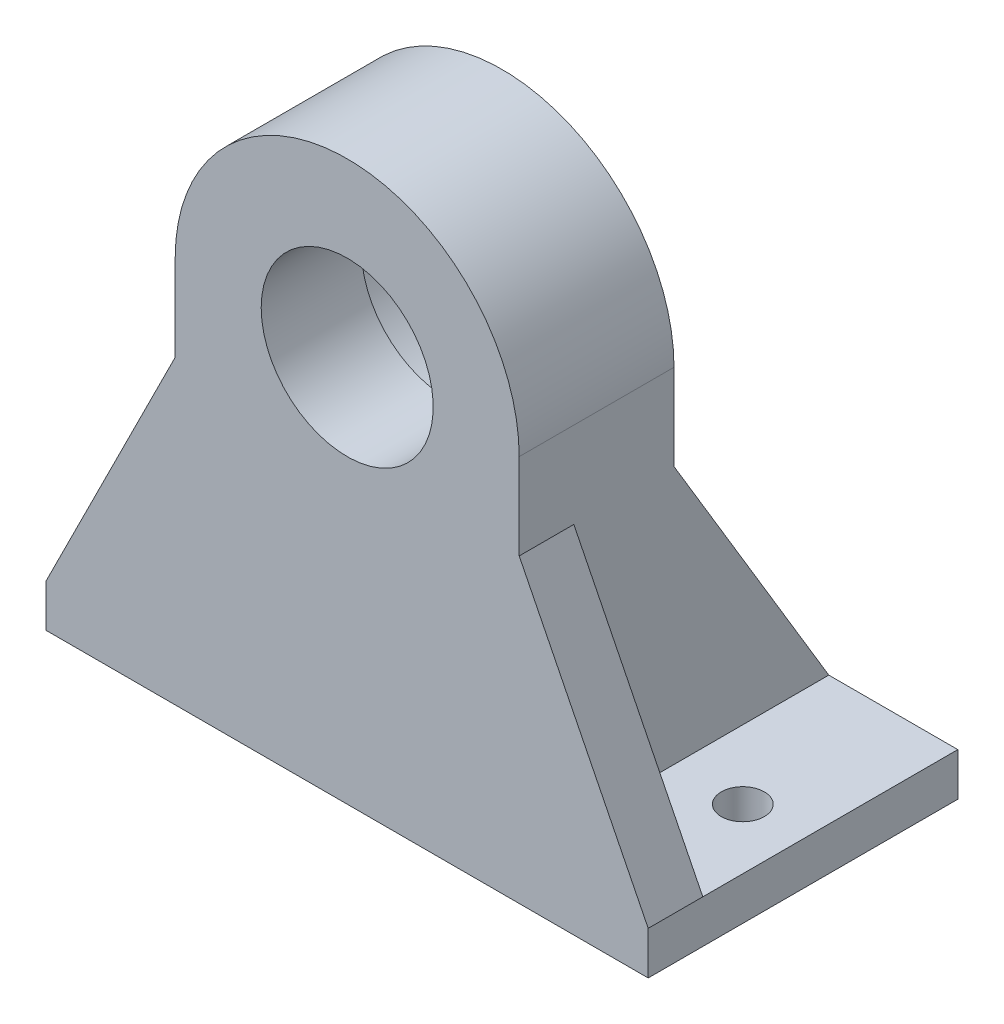
ISO-10303-21;
HEADER;
FILE_DESCRIPTION(('STEP AP214'),'2;1');
FILE_NAME('part.step','',(''),(''),'','','');
FILE_SCHEMA(('AUTOMOTIVE_DESIGN { 1 0 10303 214 1 1 1 1 }'));
ENDSEC;
DATA;
#1=APPLICATION_CONTEXT('core data for automotive mechanical design processes');
#2=APPLICATION_PROTOCOL_DEFINITION('international standard','automotive_design',2000,#1);
#3=PRODUCT_CONTEXT('',#1,'mechanical');
#4=PRODUCT('Part','Part','',(#3));
#5=PRODUCT_RELATED_PRODUCT_CATEGORY('part','',(#4));
#6=PRODUCT_DEFINITION_FORMATION('','',#4);
#7=PRODUCT_DEFINITION_CONTEXT('part definition',#1,'design');
#8=PRODUCT_DEFINITION('design','',#6,#7);
#9=PRODUCT_DEFINITION_SHAPE('','',#8);
#10=(LENGTH_UNIT() NAMED_UNIT(*) SI_UNIT(.MILLI.,.METRE.));
#11=(NAMED_UNIT(*) PLANE_ANGLE_UNIT() SI_UNIT($,.RADIAN.));
#12=(NAMED_UNIT(*) SI_UNIT($,.STERADIAN.) SOLID_ANGLE_UNIT());
#13=UNCERTAINTY_MEASURE_WITH_UNIT(LENGTH_MEASURE(1.E-05),#10,'distance_accuracy_value','');
#14=(GEOMETRIC_REPRESENTATION_CONTEXT(3) GLOBAL_UNCERTAINTY_ASSIGNED_CONTEXT((#13)) GLOBAL_UNIT_ASSIGNED_CONTEXT((#10,
#11,#12)) REPRESENTATION_CONTEXT('',''));
#15=CARTESIAN_POINT('',(0.,0.,0.));
#16=DIRECTION('',(0.,0.,1.));
#17=DIRECTION('',(1.,0.,0.));
#18=AXIS2_PLACEMENT_3D('',#15,#16,#17);
#19=CARTESIAN_POINT('',(0.,0.,0.));
#20=DIRECTION('',(0.,0.,1.));
#21=DIRECTION('',(1.,0.,0.));
#22=AXIS2_PLACEMENT_3D('',#19,#20,#21);
#23=PLANE('',#22);
#24=CARTESIAN_POINT('',(0.,0.,0.));
#25=DIRECTION('',(0.,0.,1.));
#26=DIRECTION('',(1.,0.,0.));
#27=AXIS2_PLACEMENT_3D('',#24,#25,#26);
#28=CIRCLE('',#27,14.7875);
#29=CARTESIAN_POINT('',(14.7875,0.,0.));
#30=VERTEX_POINT('',#29);
#31=EDGE_CURVE('E11',#30,#30,#28,.T.);
#32=ORIENTED_EDGE('',*,*,#31,.T.);
#33=EDGE_LOOP('',(#32));
#34=FACE_BOUND('',#33,.T.);
#35=DIRECTION('',(-1.,0.,0.));
#36=VECTOR('',#35,1.);
#37=CARTESIAN_POINT('',(-13.65,-10.,0.));
#38=LINE('',#37,#36);
#39=CARTESIAN_POINT('',(-13.65,-10.,0.));
#40=VERTEX_POINT('',#39);
#41=CARTESIAN_POINT('',(-20.,-10.,0.));
#42=VERTEX_POINT('',#41);
#43=EDGE_CURVE('E205',#40,#42,#38,.T.);
#44=ORIENTED_EDGE('',*,*,#43,.T.);
#45=DIRECTION('',(0.,-1.,0.));
#46=VECTOR('',#45,1.);
#47=CARTESIAN_POINT('',(-20.,0.,0.));
#48=LINE('',#47,#46);
#49=CARTESIAN_POINT('',(-20.,0.,0.));
#50=VERTEX_POINT('',#49);
#51=EDGE_CURVE('E292',#50,#42,#48,.T.);
#52=ORIENTED_EDGE('',*,*,#51,.F.);
#53=CARTESIAN_POINT('',(0.,0.,0.));
#54=DIRECTION('',(0.,0.,1.));
#55=DIRECTION('',(1.,0.,0.));
#56=AXIS2_PLACEMENT_3D('',#53,#54,#55);
#57=CIRCLE('',#56,20.);
#58=CARTESIAN_POINT('',(20.,0.,0.));
#59=VERTEX_POINT('',#58);
#60=EDGE_CURVE('E280',#59,#50,#57,.T.);
#61=ORIENTED_EDGE('',*,*,#60,.F.);
#62=DIRECTION('',(0.,1.,0.));
#63=VECTOR('',#62,1.);
#64=CARTESIAN_POINT('',(20.,-40.,0.));
#65=LINE('',#64,#63);
#66=CARTESIAN_POINT('',(20.,-10.,0.));
#67=VERTEX_POINT('',#66);
#68=EDGE_CURVE('E285',#67,#59,#65,.T.);
#69=ORIENTED_EDGE('',*,*,#68,.F.);
#70=DIRECTION('',(1.,0.,0.));
#71=VECTOR('',#70,1.);
#72=CARTESIAN_POINT('',(13.65,-10.,0.));
#73=LINE('',#72,#71);
#74=CARTESIAN_POINT('',(13.65,-10.,0.));
#75=VERTEX_POINT('',#74);
#76=EDGE_CURVE('E224',#75,#67,#73,.T.);
#77=ORIENTED_EDGE('',*,*,#76,.F.);
#78=DIRECTION('',(0.,-1.,0.));
#79=VECTOR('',#78,1.);
#80=CARTESIAN_POINT('',(13.65,-10.,0.));
#81=LINE('',#80,#79);
#82=CARTESIAN_POINT('',(13.65,-40.,0.));
#83=VERTEX_POINT('',#82);
#84=EDGE_CURVE('E218',#75,#83,#81,.T.);
#85=ORIENTED_EDGE('',*,*,#84,.T.);
#86=DIRECTION('',(1.,0.,0.));
#87=VECTOR('',#86,1.);
#88=CARTESIAN_POINT('',(-20.,-40.,0.));
#89=LINE('',#88,#87);
#90=CARTESIAN_POINT('',(-13.65,-40.,0.));
#91=VERTEX_POINT('',#90);
#92=EDGE_CURVE('E295',#91,#83,#89,.T.);
#93=ORIENTED_EDGE('',*,*,#92,.F.);
#94=DIRECTION('',(0.,-1.,0.));
#95=VECTOR('',#94,1.);
#96=CARTESIAN_POINT('',(-13.65,-10.,0.));
#97=LINE('',#96,#95);
#98=EDGE_CURVE('E201',#40,#91,#97,.T.);
#99=ORIENTED_EDGE('',*,*,#98,.F.);
#100=EDGE_LOOP('',(#44,#52,#61,#69,#77,#85,#93,#99));
#101=FACE_BOUND('',#100,.T.);
#102=ADVANCED_FACE('F51',(#34,#101),#23,.F.);
#103=CARTESIAN_POINT('',(0.,-40.,0.));
#104=DIRECTION('',(0.,1.,0.));
#105=DIRECTION('',(0.,0.,1.));
#106=AXIS2_PLACEMENT_3D('',#103,#104,#105);
#107=PLANE('',#106);
#108=DIRECTION('',(1.,0.,0.));
#109=VECTOR('',#108,1.);
#110=CARTESIAN_POINT('',(-35.,-40.,11.65));
#111=LINE('',#110,#109);
#112=CARTESIAN_POINT('',(-35.,-40.,11.65));
#113=VERTEX_POINT('',#112);
#114=CARTESIAN_POINT('',(-20.,-40.,11.65));
#115=VERTEX_POINT('',#114);
#116=EDGE_CURVE('E67',#113,#115,#111,.T.);
#117=ORIENTED_EDGE('',*,*,#116,.T.);
#118=DIRECTION('',(0.,0.,-1.));
#119=VECTOR('',#118,1.);
#120=CARTESIAN_POINT('',(-20.,-40.,18.));
#121=LINE('',#120,#119);
#122=CARTESIAN_POINT('',(-20.,-40.,-18.));
#123=VERTEX_POINT('',#122);
#124=EDGE_CURVE('E302',#115,#123,#121,.T.);
#125=ORIENTED_EDGE('',*,*,#124,.T.);
#126=DIRECTION('',(1.,0.,0.));
#127=VECTOR('',#126,1.);
#128=CARTESIAN_POINT('',(-35.,-40.,-18.));
#129=LINE('',#128,#127);
#130=CARTESIAN_POINT('',(-35.,-40.,-18.));
#131=VERTEX_POINT('',#130);
#132=EDGE_CURVE('E252',#131,#123,#129,.T.);
#133=ORIENTED_EDGE('',*,*,#132,.F.);
#134=DIRECTION('',(0.,0.,-1.));
#135=VECTOR('',#134,1.);
#136=CARTESIAN_POINT('',(-35.,-40.,-18.));
#137=LINE('',#136,#135);
#138=EDGE_CURVE('E261',#113,#131,#137,.T.);
#139=ORIENTED_EDGE('',*,*,#138,.F.);
#140=EDGE_LOOP('',(#117,#125,#133,#139));
#141=FACE_BOUND('',#140,.T.);
#142=CARTESIAN_POINT('',(-28.,-40.,0.));
#143=DIRECTION('',(0.,-1.,0.));
#144=DIRECTION('',(0.,0.,-1.));
#145=AXIS2_PLACEMENT_3D('',#142,#143,#144);
#146=CIRCLE('',#145,2.5);
#147=CARTESIAN_POINT('',(-28.,-40.,-2.5));
#148=VERTEX_POINT('',#147);
#149=EDGE_CURVE('E235',#148,#148,#146,.T.);
#150=ORIENTED_EDGE('',*,*,#149,.T.);
#151=EDGE_LOOP('',(#150));
#152=FACE_BOUND('',#151,.T.);
#153=ADVANCED_FACE('F328',(#141,#152),#107,.T.);
#154=DIRECTION('',(1.,0.,0.));
#155=VECTOR('',#154,1.);
#156=CARTESIAN_POINT('',(20.,-40.,11.65));
#157=LINE('',#156,#155);
#158=CARTESIAN_POINT('',(20.,-40.,11.65));
#159=VERTEX_POINT('',#158);
#160=CARTESIAN_POINT('',(35.,-40.,11.65));
#161=VERTEX_POINT('',#160);
#162=EDGE_CURVE('E165',#159,#161,#157,.T.);
#163=ORIENTED_EDGE('',*,*,#162,.T.);
#164=DIRECTION('',(0.,0.,1.));
#165=VECTOR('',#164,1.);
#166=CARTESIAN_POINT('',(35.,-40.,-18.));
#167=LINE('',#166,#165);
#168=CARTESIAN_POINT('',(35.,-40.,-18.));
#169=VERTEX_POINT('',#168);
#170=EDGE_CURVE('E245',#169,#161,#167,.T.);
#171=ORIENTED_EDGE('',*,*,#170,.F.);
#172=CARTESIAN_POINT('',(20.,-40.,-18.));
#173=VERTEX_POINT('',#172);
#174=EDGE_CURVE('E265',#173,#169,#129,.T.);
#175=ORIENTED_EDGE('',*,*,#174,.F.);
#176=DIRECTION('',(0.,0.,-1.));
#177=VECTOR('',#176,1.);
#178=CARTESIAN_POINT('',(20.,-40.,18.));
#179=LINE('',#178,#177);
#180=EDGE_CURVE('E300',#159,#173,#179,.T.);
#181=ORIENTED_EDGE('',*,*,#180,.F.);
#182=EDGE_LOOP('',(#163,#171,#175,#181));
#183=FACE_BOUND('',#182,.T.);
#184=CARTESIAN_POINT('',(28.,-40.,0.));
#185=DIRECTION('',(0.,-1.,0.));
#186=DIRECTION('',(0.,0.,-1.));
#187=AXIS2_PLACEMENT_3D('',#184,#185,#186);
#188=CIRCLE('',#187,2.5);
#189=CARTESIAN_POINT('',(28.,-40.,-2.5));
#190=VERTEX_POINT('',#189);
#191=EDGE_CURVE('E239',#190,#190,#188,.T.);
#192=ORIENTED_EDGE('',*,*,#191,.T.);
#193=EDGE_LOOP('',(#192));
#194=FACE_BOUND('',#193,.T.);
#195=ADVANCED_FACE('F336',(#183,#194),#107,.T.);
#196=CARTESIAN_POINT('',(0.,0.,18.));
#197=DIRECTION('',(0.,0.,-1.));
#198=DIRECTION('',(-1.,0.,0.));
#199=AXIS2_PLACEMENT_3D('',#196,#197,#198);
#200=CYLINDRICAL_SURFACE('',#199,10.);
#201=CARTESIAN_POINT('',(0.,0.,18.));
#202=DIRECTION('',(0.,0.,-1.));
#203=DIRECTION('',(-1.,0.,0.));
#204=AXIS2_PLACEMENT_3D('',#201,#202,#203);
#205=CIRCLE('',#204,10.);
#206=CARTESIAN_POINT('',(-10.,0.,18.));
#207=VERTEX_POINT('',#206);
#208=EDGE_CURVE('E232',#207,#207,#205,.T.);
#209=ORIENTED_EDGE('',*,*,#208,.F.);
#210=EDGE_LOOP('',(#209));
#211=FACE_BOUND('',#210,.T.);
#212=CARTESIAN_POINT('',(0.,0.,6.35));
#213=DIRECTION('',(0.,0.,-1.));
#214=DIRECTION('',(-1.,0.,0.));
#215=AXIS2_PLACEMENT_3D('',#212,#213,#214);
#216=CIRCLE('',#215,10.);
#217=CARTESIAN_POINT('',(-10.,0.,6.35));
#218=VERTEX_POINT('',#217);
#219=EDGE_CURVE('E231',#218,#218,#216,.F.);
#220=ORIENTED_EDGE('',*,*,#219,.F.);
#221=EDGE_LOOP('',(#220));
#222=FACE_BOUND('',#221,.T.);
#223=ADVANCED_FACE('F352',(#211,#222),#200,.F.);
#224=CARTESIAN_POINT('',(0.,0.,18.));
#225=DIRECTION('',(0.,0.,-1.));
#226=DIRECTION('',(-1.,0.,0.));
#227=AXIS2_PLACEMENT_3D('',#224,#225,#226);
#228=CYLINDRICAL_SURFACE('',#227,20.);
#229=ORIENTED_EDGE('',*,*,#60,.T.);
#230=DIRECTION('',(0.,0.,-1.));
#231=VECTOR('',#230,1.);
#232=CARTESIAN_POINT('',(-20.,0.,18.));
#233=LINE('',#232,#231);
#234=CARTESIAN_POINT('',(-20.,0.,18.));
#235=VERTEX_POINT('',#234);
#236=EDGE_CURVE('E304',#235,#50,#233,.T.);
#237=ORIENTED_EDGE('',*,*,#236,.F.);
#238=CARTESIAN_POINT('',(0.,0.,18.));
#239=DIRECTION('',(0.,0.,1.));
#240=DIRECTION('',(1.,0.,0.));
#241=AXIS2_PLACEMENT_3D('',#238,#239,#240);
#242=CIRCLE('',#241,20.);
#243=CARTESIAN_POINT('',(20.,0.,18.));
#244=VERTEX_POINT('',#243);
#245=EDGE_CURVE('E281',#244,#235,#242,.T.);
#246=ORIENTED_EDGE('',*,*,#245,.F.);
#247=DIRECTION('',(0.,0.,-1.));
#248=VECTOR('',#247,1.);
#249=CARTESIAN_POINT('',(20.,0.,18.));
#250=LINE('',#249,#248);
#251=EDGE_CURVE('E289',#244,#59,#250,.T.);
#252=ORIENTED_EDGE('',*,*,#251,.T.);
#253=EDGE_LOOP('',(#229,#237,#246,#252));
#254=FACE_BOUND('',#253,.T.);
#255=ADVANCED_FACE('F349',(#254),#228,.T.);
#256=CARTESIAN_POINT('',(-20.,0.,18.));
#257=DIRECTION('',(1.,0.,0.));
#258=DIRECTION('',(0.,1.,0.));
#259=AXIS2_PLACEMENT_3D('',#256,#257,#258);
#260=PLANE('',#259);
#261=DIRECTION('',(0.,1.,0.));
#262=VECTOR('',#261,1.);
#263=CARTESIAN_POINT('',(-20.,-40.,11.65));
#264=LINE('',#263,#262);
#265=CARTESIAN_POINT('',(-20.,-10.,11.65));
#266=VERTEX_POINT('',#265);
#267=EDGE_CURVE('E188',#115,#266,#264,.T.);
#268=ORIENTED_EDGE('',*,*,#267,.T.);
#269=DIRECTION('',(0.,0.,1.));
#270=VECTOR('',#269,1.);
#271=CARTESIAN_POINT('',(-20.,-10.,11.65));
#272=LINE('',#271,#270);
#273=CARTESIAN_POINT('',(-20.,-10.,18.));
#274=VERTEX_POINT('',#273);
#275=EDGE_CURVE('E194',#266,#274,#272,.T.);
#276=ORIENTED_EDGE('',*,*,#275,.T.);
#277=DIRECTION('',(0.,-1.,0.));
#278=VECTOR('',#277,1.);
#279=CARTESIAN_POINT('',(-20.,0.,18.));
#280=LINE('',#279,#278);
#281=EDGE_CURVE('E284',#235,#274,#280,.T.);
#282=ORIENTED_EDGE('',*,*,#281,.F.);
#283=ORIENTED_EDGE('',*,*,#236,.T.);
#284=ORIENTED_EDGE('',*,*,#51,.T.);
#285=DIRECTION('',(0.,0.857492925712544,0.514495755427527));
#286=VECTOR('',#285,1.);
#287=CARTESIAN_POINT('',(-20.,-40.,-18.));
#288=LINE('',#287,#286);
#289=EDGE_CURVE('E199',#123,#42,#288,.T.);
#290=ORIENTED_EDGE('',*,*,#289,.F.);
#291=ORIENTED_EDGE('',*,*,#124,.F.);
#292=EDGE_LOOP('',(#268,#276,#282,#283,#284,#290,#291));
#293=FACE_BOUND('',#292,.T.);
#294=ADVANCED_FACE('F347',(#293),#260,.F.);
#295=CARTESIAN_POINT('',(20.,-40.,18.));
#296=DIRECTION('',(-1.,0.,0.));
#297=DIRECTION('',(0.,-1.,0.));
#298=AXIS2_PLACEMENT_3D('',#295,#296,#297);
#299=PLANE('',#298);
#300=DIRECTION('',(0.,1.,0.));
#301=VECTOR('',#300,1.);
#302=CARTESIAN_POINT('',(20.,-40.,18.));
#303=LINE('',#302,#301);
#304=CARTESIAN_POINT('',(20.,-10.,18.));
#305=VERTEX_POINT('',#304);
#306=EDGE_CURVE('E181',#305,#244,#303,.T.);
#307=ORIENTED_EDGE('',*,*,#306,.F.);
#308=DIRECTION('',(0.,0.,1.));
#309=VECTOR('',#308,1.);
#310=CARTESIAN_POINT('',(20.,-10.,11.65));
#311=LINE('',#310,#309);
#312=CARTESIAN_POINT('',(20.,-10.,11.65));
#313=VERTEX_POINT('',#312);
#314=EDGE_CURVE('E172',#313,#305,#311,.T.);
#315=ORIENTED_EDGE('',*,*,#314,.F.);
#316=DIRECTION('',(0.,-1.,0.));
#317=VECTOR('',#316,1.);
#318=CARTESIAN_POINT('',(20.,-10.,11.65));
#319=LINE('',#318,#317);
#320=EDGE_CURVE('E160',#313,#159,#319,.T.);
#321=ORIENTED_EDGE('',*,*,#320,.T.);
#322=ORIENTED_EDGE('',*,*,#180,.T.);
#323=DIRECTION('',(0.,0.857492925712544,0.514495755427527));
#324=VECTOR('',#323,1.);
#325=CARTESIAN_POINT('',(20.,-40.,-18.));
#326=LINE('',#325,#324);
#327=EDGE_CURVE('E210',#173,#67,#326,.T.);
#328=ORIENTED_EDGE('',*,*,#327,.T.);
#329=ORIENTED_EDGE('',*,*,#68,.T.);
#330=ORIENTED_EDGE('',*,*,#251,.F.);
#331=EDGE_LOOP('',(#307,#315,#321,#322,#328,#329,#330));
#332=FACE_BOUND('',#331,.T.);
#333=ADVANCED_FACE('F179',(#332),#299,.F.);
#334=CARTESIAN_POINT('',(0.,0.,18.));
#335=DIRECTION('',(0.,0.,1.));
#336=DIRECTION('',(1.,0.,0.));
#337=AXIS2_PLACEMENT_3D('',#334,#335,#336);
#338=PLANE('',#337);
#339=ORIENTED_EDGE('',*,*,#281,.T.);
#340=DIRECTION('',(-0.447213595499958,-0.894427190999916,0.));
#341=VECTOR('',#340,1.);
#342=CARTESIAN_POINT('',(-20.,-10.,18.));
#343=LINE('',#342,#341);
#344=CARTESIAN_POINT('',(-35.,-40.,18.));
#345=VERTEX_POINT('',#344);
#346=EDGE_CURVE('E183',#274,#345,#343,.T.);
#347=ORIENTED_EDGE('',*,*,#346,.T.);
#348=DIRECTION('',(0.,1.,0.));
#349=VECTOR('',#348,1.);
#350=CARTESIAN_POINT('',(-35.,-45.,18.));
#351=LINE('',#350,#349);
#352=CARTESIAN_POINT('',(-35.,-45.,18.));
#353=VERTEX_POINT('',#352);
#354=EDGE_CURVE('E274',#353,#345,#351,.T.);
#355=ORIENTED_EDGE('',*,*,#354,.F.);
#356=DIRECTION('',(-1.,0.,0.));
#357=VECTOR('',#356,1.);
#358=CARTESIAN_POINT('',(-35.,-45.,18.));
#359=LINE('',#358,#357);
#360=CARTESIAN_POINT('',(35.,-45.,18.));
#361=VERTEX_POINT('',#360);
#362=EDGE_CURVE('E251',#361,#353,#359,.T.);
#363=ORIENTED_EDGE('',*,*,#362,.F.);
#364=DIRECTION('',(0.,1.,0.));
#365=VECTOR('',#364,1.);
#366=CARTESIAN_POINT('',(35.,-45.,18.));
#367=LINE('',#366,#365);
#368=CARTESIAN_POINT('',(35.,-40.,18.));
#369=VERTEX_POINT('',#368);
#370=EDGE_CURVE('E277',#361,#369,#367,.T.);
#371=ORIENTED_EDGE('',*,*,#370,.T.);
#372=DIRECTION('',(-0.447213595499958,0.894427190999916,0.));
#373=VECTOR('',#372,1.);
#374=CARTESIAN_POINT('',(35.,-40.,18.));
#375=LINE('',#374,#373);
#376=EDGE_CURVE('E176',#369,#305,#375,.T.);
#377=ORIENTED_EDGE('',*,*,#376,.T.);
#378=ORIENTED_EDGE('',*,*,#306,.T.);
#379=ORIENTED_EDGE('',*,*,#245,.T.);
#380=EDGE_LOOP('',(#339,#347,#355,#363,#371,#377,#378,#379));
#381=FACE_BOUND('',#380,.T.);
#382=ORIENTED_EDGE('',*,*,#208,.T.);
#383=EDGE_LOOP('',(#382));
#384=FACE_BOUND('',#383,.T.);
#385=ADVANCED_FACE('F343',(#381,#384),#338,.T.);
#386=DIRECTION('',(0.,0.,-1.));
#387=VECTOR('',#386,1.);
#388=CARTESIAN_POINT('',(-13.65,-40.,0.));
#389=LINE('',#388,#387);
#390=CARTESIAN_POINT('',(-13.65,-40.,-18.));
#391=VERTEX_POINT('',#390);
#392=EDGE_CURVE('E75',#91,#391,#389,.T.);
#393=ORIENTED_EDGE('',*,*,#392,.F.);
#394=ORIENTED_EDGE('',*,*,#92,.T.);
#395=DIRECTION('',(0.,0.,-1.));
#396=VECTOR('',#395,1.);
#397=CARTESIAN_POINT('',(13.65,-40.,0.));
#398=LINE('',#397,#396);
#399=CARTESIAN_POINT('',(13.65,-40.,-18.));
#400=VERTEX_POINT('',#399);
#401=EDGE_CURVE('E213',#83,#400,#398,.T.);
#402=ORIENTED_EDGE('',*,*,#401,.T.);
#403=EDGE_CURVE('E268',#391,#400,#129,.T.);
#404=ORIENTED_EDGE('',*,*,#403,.F.);
#405=EDGE_LOOP('',(#393,#394,#402,#404));
#406=FACE_BOUND('',#405,.T.);
#407=ADVANCED_FACE('F339',(#406),#107,.T.);
#408=CARTESIAN_POINT('',(0.,-45.,0.));
#409=DIRECTION('',(0.,1.,0.));
#410=DIRECTION('',(0.,0.,1.));
#411=AXIS2_PLACEMENT_3D('',#408,#409,#410);
#412=PLANE('',#411);
#413=DIRECTION('',(0.,0.,1.));
#414=VECTOR('',#413,1.);
#415=CARTESIAN_POINT('',(35.,-45.,-18.));
#416=LINE('',#415,#414);
#417=CARTESIAN_POINT('',(35.,-45.,-18.));
#418=VERTEX_POINT('',#417);
#419=EDGE_CURVE('E248',#418,#361,#416,.T.);
#420=ORIENTED_EDGE('',*,*,#419,.T.);
#421=ORIENTED_EDGE('',*,*,#362,.T.);
#422=DIRECTION('',(0.,0.,-1.));
#423=VECTOR('',#422,1.);
#424=CARTESIAN_POINT('',(-35.,-45.,-18.));
#425=LINE('',#424,#423);
#426=CARTESIAN_POINT('',(-35.,-45.,-18.));
#427=VERTEX_POINT('',#426);
#428=EDGE_CURVE('E254',#353,#427,#425,.T.);
#429=ORIENTED_EDGE('',*,*,#428,.T.);
#430=DIRECTION('',(1.,0.,0.));
#431=VECTOR('',#430,1.);
#432=CARTESIAN_POINT('',(-35.,-45.,-18.));
#433=LINE('',#432,#431);
#434=EDGE_CURVE('E256',#427,#418,#433,.T.);
#435=ORIENTED_EDGE('',*,*,#434,.T.);
#436=EDGE_LOOP('',(#420,#421,#429,#435));
#437=FACE_BOUND('',#436,.T.);
#438=CARTESIAN_POINT('',(28.,-45.,0.));
#439=DIRECTION('',(0.,-1.,0.));
#440=DIRECTION('',(0.,0.,-1.));
#441=AXIS2_PLACEMENT_3D('',#438,#439,#440);
#442=CIRCLE('',#441,2.5);
#443=CARTESIAN_POINT('',(28.,-45.,-2.5));
#444=VERTEX_POINT('',#443);
#445=EDGE_CURVE('E242',#444,#444,#442,.T.);
#446=ORIENTED_EDGE('',*,*,#445,.F.);
#447=EDGE_LOOP('',(#446));
#448=FACE_BOUND('',#447,.T.);
#449=CARTESIAN_POINT('',(-28.,-45.,0.));
#450=DIRECTION('',(0.,-1.,0.));
#451=DIRECTION('',(0.,0.,-1.));
#452=AXIS2_PLACEMENT_3D('',#449,#450,#451);
#453=CIRCLE('',#452,2.5);
#454=CARTESIAN_POINT('',(-28.,-45.,-2.5));
#455=VERTEX_POINT('',#454);
#456=EDGE_CURVE('E236',#455,#455,#453,.T.);
#457=ORIENTED_EDGE('',*,*,#456,.F.);
#458=EDGE_LOOP('',(#457));
#459=FACE_BOUND('',#458,.T.);
#460=ADVANCED_FACE('F403',(#437,#448,#459),#412,.F.);
#461=CARTESIAN_POINT('',(35.,-45.,-18.));
#462=DIRECTION('',(-1.,0.,0.));
#463=DIRECTION('',(0.,0.,1.));
#464=AXIS2_PLACEMENT_3D('',#461,#462,#463);
#465=PLANE('',#464);
#466=ORIENTED_EDGE('',*,*,#170,.T.);
#467=DIRECTION('',(0.,0.,1.));
#468=VECTOR('',#467,1.);
#469=CARTESIAN_POINT('',(35.,-40.,11.65));
#470=LINE('',#469,#468);
#471=EDGE_CURVE('E175',#161,#369,#470,.T.);
#472=ORIENTED_EDGE('',*,*,#471,.T.);
#473=ORIENTED_EDGE('',*,*,#370,.F.);
#474=ORIENTED_EDGE('',*,*,#419,.F.);
#475=DIRECTION('',(0.,1.,0.));
#476=VECTOR('',#475,1.);
#477=CARTESIAN_POINT('',(35.,-45.,-18.));
#478=LINE('',#477,#476);
#479=EDGE_CURVE('E258',#418,#169,#478,.T.);
#480=ORIENTED_EDGE('',*,*,#479,.T.);
#481=EDGE_LOOP('',(#466,#472,#473,#474,#480));
#482=FACE_BOUND('',#481,.T.);
#483=ADVANCED_FACE('F408',(#482),#465,.F.);
#484=CARTESIAN_POINT('',(-35.,-45.,-18.));
#485=DIRECTION('',(1.,0.,0.));
#486=DIRECTION('',(0.,0.,-1.));
#487=AXIS2_PLACEMENT_3D('',#484,#485,#486);
#488=PLANE('',#487);
#489=EDGE_CURVE('E262',#345,#113,#137,.T.);
#490=ORIENTED_EDGE('',*,*,#489,.T.);
#491=ORIENTED_EDGE('',*,*,#138,.T.);
#492=DIRECTION('',(0.,1.,0.));
#493=VECTOR('',#492,1.);
#494=CARTESIAN_POINT('',(-35.,-45.,-18.));
#495=LINE('',#494,#493);
#496=EDGE_CURVE('E271',#427,#131,#495,.T.);
#497=ORIENTED_EDGE('',*,*,#496,.F.);
#498=ORIENTED_EDGE('',*,*,#428,.F.);
#499=ORIENTED_EDGE('',*,*,#354,.T.);
#500=EDGE_LOOP('',(#490,#491,#497,#498,#499));
#501=FACE_BOUND('',#500,.T.);
#502=ADVANCED_FACE('F396',(#501),#488,.F.);
#503=CARTESIAN_POINT('',(-35.,-45.,-18.));
#504=DIRECTION('',(0.,0.,1.));
#505=DIRECTION('',(1.,0.,0.));
#506=AXIS2_PLACEMENT_3D('',#503,#504,#505);
#507=PLANE('',#506);
#508=ORIENTED_EDGE('',*,*,#132,.T.);
#509=DIRECTION('',(-1.,0.,0.));
#510=VECTOR('',#509,1.);
#511=CARTESIAN_POINT('',(-13.65,-40.,-18.));
#512=LINE('',#511,#510);
#513=EDGE_CURVE('E207',#391,#123,#512,.T.);
#514=ORIENTED_EDGE('',*,*,#513,.F.);
#515=ORIENTED_EDGE('',*,*,#403,.T.);
#516=DIRECTION('',(1.,0.,0.));
#517=VECTOR('',#516,1.);
#518=CARTESIAN_POINT('',(13.65,-40.,-18.));
#519=LINE('',#518,#517);
#520=EDGE_CURVE('E221',#400,#173,#519,.T.);
#521=ORIENTED_EDGE('',*,*,#520,.T.);
#522=ORIENTED_EDGE('',*,*,#174,.T.);
#523=ORIENTED_EDGE('',*,*,#479,.F.);
#524=ORIENTED_EDGE('',*,*,#434,.F.);
#525=ORIENTED_EDGE('',*,*,#496,.T.);
#526=EDGE_LOOP('',(#508,#514,#515,#521,#522,#523,#524,#525));
#527=FACE_BOUND('',#526,.T.);
#528=ADVANCED_FACE('F379',(#527),#507,.F.);
#529=CARTESIAN_POINT('',(28.,-45.,0.));
#530=DIRECTION('',(0.,1.,0.));
#531=DIRECTION('',(0.,0.,1.));
#532=AXIS2_PLACEMENT_3D('',#529,#530,#531);
#533=CYLINDRICAL_SURFACE('',#532,2.5);
#534=ORIENTED_EDGE('',*,*,#445,.T.);
#535=EDGE_LOOP('',(#534));
#536=FACE_BOUND('',#535,.T.);
#537=ORIENTED_EDGE('',*,*,#191,.F.);
#538=EDGE_LOOP('',(#537));
#539=FACE_BOUND('',#538,.T.);
#540=ADVANCED_FACE('F418',(#536,#539),#533,.F.);
#541=CARTESIAN_POINT('',(-28.,-45.,0.));
#542=DIRECTION('',(0.,1.,0.));
#543=DIRECTION('',(0.,0.,1.));
#544=AXIS2_PLACEMENT_3D('',#541,#542,#543);
#545=CYLINDRICAL_SURFACE('',#544,2.5);
#546=ORIENTED_EDGE('',*,*,#456,.T.);
#547=EDGE_LOOP('',(#546));
#548=FACE_BOUND('',#547,.T.);
#549=ORIENTED_EDGE('',*,*,#149,.F.);
#550=EDGE_LOOP('',(#549));
#551=FACE_BOUND('',#550,.T.);
#552=ADVANCED_FACE('F422',(#548,#551),#545,.F.);
#553=CARTESIAN_POINT('',(0.,0.,6.35));
#554=DIRECTION('',(0.,0.,-1.));
#555=DIRECTION('',(-1.,0.,0.));
#556=AXIS2_PLACEMENT_3D('',#553,#554,#555);
#557=PLANE('',#556);
#558=CARTESIAN_POINT('',(0.,0.,6.35));
#559=DIRECTION('',(0.,0.,-1.));
#560=DIRECTION('',(-1.,0.,0.));
#561=AXIS2_PLACEMENT_3D('',#558,#559,#560);
#562=CIRCLE('',#561,14.2875);
#563=CARTESIAN_POINT('',(-14.2875,0.,6.35));
#564=VERTEX_POINT('',#563);
#565=EDGE_CURVE('E226',#564,#564,#562,.T.);
#566=ORIENTED_EDGE('',*,*,#565,.T.);
#567=EDGE_LOOP('',(#566));
#568=FACE_BOUND('',#567,.T.);
#569=ORIENTED_EDGE('',*,*,#219,.T.);
#570=EDGE_LOOP('',(#569));
#571=FACE_BOUND('',#570,.T.);
#572=ADVANCED_FACE('F324',(#568,#571),#557,.T.);
#573=CARTESIAN_POINT('',(0.,0.,6.35));
#574=DIRECTION('',(0.,0.,-1.));
#575=DIRECTION('',(-1.,0.,0.));
#576=AXIS2_PLACEMENT_3D('',#573,#574,#575);
#577=CYLINDRICAL_SURFACE('',#576,14.2875);
#578=CARTESIAN_POINT('',(0.,0.,0.500000000000002));
#579=DIRECTION('',(0.,0.,1.));
#580=DIRECTION('',(1.,0.,0.));
#581=AXIS2_PLACEMENT_3D('',#578,#579,#580);
#582=CIRCLE('',#581,14.2875);
#583=CARTESIAN_POINT('',(14.2875,0.,0.500000000000002));
#584=VERTEX_POINT('',#583);
#585=EDGE_CURVE('E60',#584,#584,#582,.F.);
#586=ORIENTED_EDGE('',*,*,#585,.T.);
#587=EDGE_LOOP('',(#586));
#588=FACE_BOUND('',#587,.T.);
#589=ORIENTED_EDGE('',*,*,#565,.F.);
#590=EDGE_LOOP('',(#589));
#591=FACE_BOUND('',#590,.T.);
#592=ADVANCED_FACE('F311',(#588,#591),#577,.F.);
#593=CARTESIAN_POINT('',(0.,0.,0.500000000000002));
#594=DIRECTION('',(0.,0.,-1.));
#595=DIRECTION('',(-1.,0.,0.));
#596=AXIS2_PLACEMENT_3D('',#593,#594,#595);
#597=CONICAL_SURFACE('',#596,14.2875,0.785398163397452);
#598=ORIENTED_EDGE('',*,*,#31,.F.);
#599=EDGE_LOOP('',(#598));
#600=FACE_BOUND('',#599,.T.);
#601=ORIENTED_EDGE('',*,*,#585,.F.);
#602=EDGE_LOOP('',(#601));
#603=FACE_BOUND('',#602,.T.);
#604=ADVANCED_FACE('F54',(#600,#603),#597,.F.);
#605=CARTESIAN_POINT('',(13.65,-40.,-18.));
#606=DIRECTION('',(0.,0.514495755427527,-0.857492925712544));
#607=DIRECTION('',(0.,0.857492925712544,0.514495755427527));
#608=AXIS2_PLACEMENT_3D('',#605,#606,#607);
#609=PLANE('',#608);
#610=ORIENTED_EDGE('',*,*,#327,.F.);
#611=ORIENTED_EDGE('',*,*,#520,.F.);
#612=DIRECTION('',(0.,0.857492925712544,0.514495755427527));
#613=VECTOR('',#612,1.);
#614=CARTESIAN_POINT('',(13.65,-40.,-18.));
#615=LINE('',#614,#613);
#616=EDGE_CURVE('E216',#400,#75,#615,.T.);
#617=ORIENTED_EDGE('',*,*,#616,.T.);
#618=ORIENTED_EDGE('',*,*,#76,.T.);
#619=EDGE_LOOP('',(#610,#611,#617,#618));
#620=FACE_BOUND('',#619,.T.);
#621=ADVANCED_FACE('F315',(#620),#609,.T.);
#622=CARTESIAN_POINT('',(13.65,0.,0.));
#623=DIRECTION('',(-1.,0.,0.));
#624=DIRECTION('',(0.,-1.,0.));
#625=AXIS2_PLACEMENT_3D('',#622,#623,#624);
#626=PLANE('',#625);
#627=ORIENTED_EDGE('',*,*,#401,.F.);
#628=ORIENTED_EDGE('',*,*,#84,.F.);
#629=ORIENTED_EDGE('',*,*,#616,.F.);
#630=EDGE_LOOP('',(#627,#628,#629));
#631=FACE_BOUND('',#630,.T.);
#632=ADVANCED_FACE('F321',(#631),#626,.T.);
#633=CARTESIAN_POINT('',(-13.65,-40.,-18.));
#634=DIRECTION('',(0.,-0.514495755427527,0.857492925712544));
#635=DIRECTION('',(0.,-0.857492925712544,-0.514495755427527));
#636=AXIS2_PLACEMENT_3D('',#633,#634,#635);
#637=PLANE('',#636);
#638=ORIENTED_EDGE('',*,*,#289,.T.);
#639=ORIENTED_EDGE('',*,*,#43,.F.);
#640=DIRECTION('',(0.,0.857492925712544,0.514495755427527));
#641=VECTOR('',#640,1.);
#642=CARTESIAN_POINT('',(-13.65,-40.,-18.));
#643=LINE('',#642,#641);
#644=EDGE_CURVE('E203',#391,#40,#643,.T.);
#645=ORIENTED_EDGE('',*,*,#644,.F.);
#646=ORIENTED_EDGE('',*,*,#513,.T.);
#647=EDGE_LOOP('',(#638,#639,#645,#646));
#648=FACE_BOUND('',#647,.T.);
#649=ADVANCED_FACE('F389',(#648),#637,.F.);
#650=CARTESIAN_POINT('',(-13.65,0.,0.));
#651=DIRECTION('',(1.,0.,0.));
#652=DIRECTION('',(0.,-1.,0.));
#653=AXIS2_PLACEMENT_3D('',#650,#651,#652);
#654=PLANE('',#653);
#655=ORIENTED_EDGE('',*,*,#392,.T.);
#656=ORIENTED_EDGE('',*,*,#644,.T.);
#657=ORIENTED_EDGE('',*,*,#98,.T.);
#658=EDGE_LOOP('',(#655,#656,#657));
#659=FACE_BOUND('',#658,.T.);
#660=ADVANCED_FACE('F387',(#659),#654,.T.);
#661=CARTESIAN_POINT('',(-20.,-10.,11.65));
#662=DIRECTION('',(-0.894427190999916,0.447213595499958,0.));
#663=DIRECTION('',(-0.447213595499958,-0.894427190999916,0.));
#664=AXIS2_PLACEMENT_3D('',#661,#662,#663);
#665=PLANE('',#664);
#666=ORIENTED_EDGE('',*,*,#346,.F.);
#667=ORIENTED_EDGE('',*,*,#275,.F.);
#668=DIRECTION('',(-0.447213595499958,-0.894427190999916,0.));
#669=VECTOR('',#668,1.);
#670=CARTESIAN_POINT('',(-20.,-10.,11.65));
#671=LINE('',#670,#669);
#672=EDGE_CURVE('E191',#266,#113,#671,.T.);
#673=ORIENTED_EDGE('',*,*,#672,.T.);
#674=ORIENTED_EDGE('',*,*,#489,.F.);
#675=EDGE_LOOP('',(#666,#667,#673,#674));
#676=FACE_BOUND('',#675,.T.);
#677=ADVANCED_FACE('F400',(#676),#665,.T.);
#678=CARTESIAN_POINT('',(0.,0.,11.65));
#679=DIRECTION('',(0.,0.,-1.));
#680=DIRECTION('',(-1.,0.,0.));
#681=AXIS2_PLACEMENT_3D('',#678,#679,#680);
#682=PLANE('',#681);
#683=ORIENTED_EDGE('',*,*,#267,.F.);
#684=ORIENTED_EDGE('',*,*,#116,.F.);
#685=ORIENTED_EDGE('',*,*,#672,.F.);
#686=EDGE_LOOP('',(#683,#684,#685));
#687=FACE_BOUND('',#686,.T.);
#688=ADVANCED_FACE('F437',(#687),#682,.T.);
#689=CARTESIAN_POINT('',(35.,-40.,11.65));
#690=DIRECTION('',(0.894427190999916,0.447213595499958,0.));
#691=DIRECTION('',(-0.447213595499958,0.894427190999916,0.));
#692=AXIS2_PLACEMENT_3D('',#689,#690,#691);
#693=PLANE('',#692);
#694=ORIENTED_EDGE('',*,*,#376,.F.);
#695=ORIENTED_EDGE('',*,*,#471,.F.);
#696=DIRECTION('',(-0.447213595499958,0.894427190999916,0.));
#697=VECTOR('',#696,1.);
#698=CARTESIAN_POINT('',(35.,-40.,11.65));
#699=LINE('',#698,#697);
#700=EDGE_CURVE('E163',#161,#313,#699,.T.);
#701=ORIENTED_EDGE('',*,*,#700,.T.);
#702=ORIENTED_EDGE('',*,*,#314,.T.);
#703=EDGE_LOOP('',(#694,#695,#701,#702));
#704=FACE_BOUND('',#703,.T.);
#705=ADVANCED_FACE('F171',(#704),#693,.T.);
#706=CARTESIAN_POINT('',(0.,0.,11.65));
#707=DIRECTION('',(0.,0.,-1.));
#708=DIRECTION('',(-1.,0.,0.));
#709=AXIS2_PLACEMENT_3D('',#706,#707,#708);
#710=PLANE('',#709);
#711=ORIENTED_EDGE('',*,*,#700,.F.);
#712=ORIENTED_EDGE('',*,*,#162,.F.);
#713=ORIENTED_EDGE('',*,*,#320,.F.);
#714=EDGE_LOOP('',(#711,#712,#713));
#715=FACE_BOUND('',#714,.T.);
#716=ADVANCED_FACE('F162',(#715),#710,.T.);
#717=CLOSED_SHELL('',(#102,#153,#195,#223,#255,#294,#333,#385,#407,#460,#483,#502,#528,#540,
#552,#572,#592,#604,#621,#632,#649,#660,#677,#688,#705,#716));
#718=MANIFOLD_SOLID_BREP('B2',#717);
#719=ADVANCED_BREP_SHAPE_REPRESENTATION('',(#18,#718),#14);
#720=SHAPE_DEFINITION_REPRESENTATION(#9,#719);
ENDSEC;
END-ISO-10303-21;
